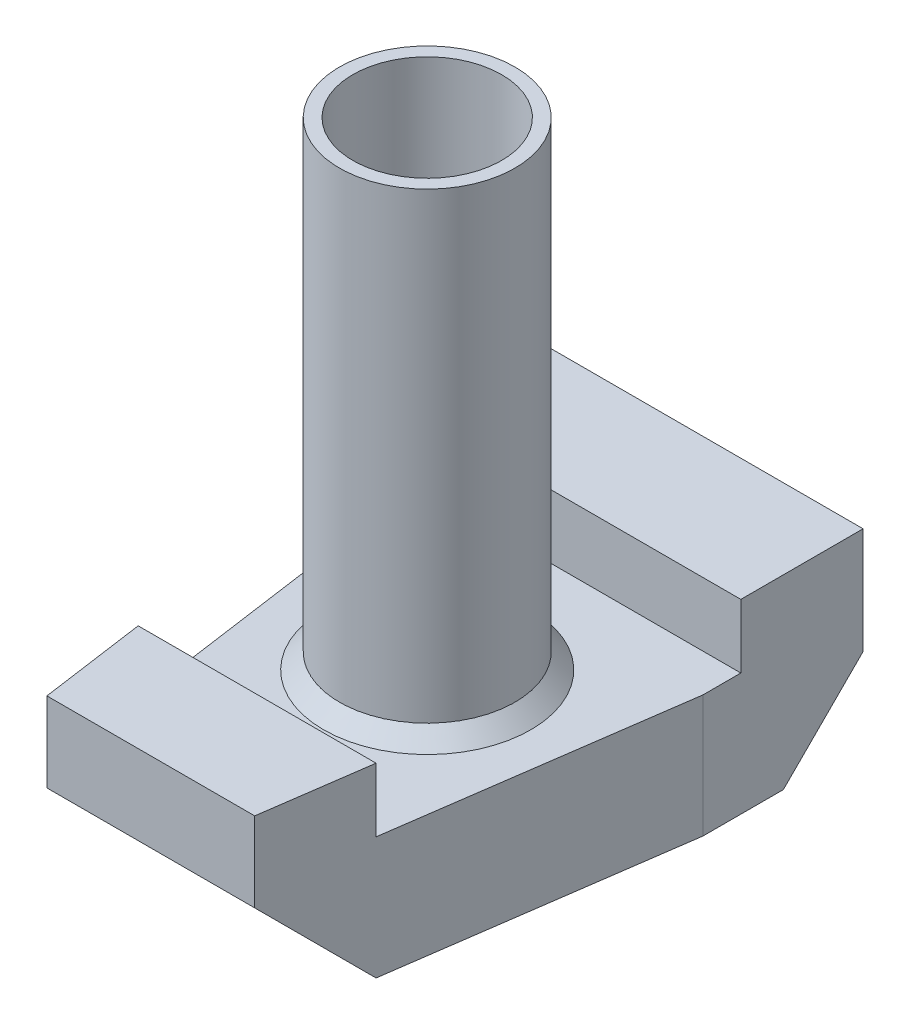
ISO-10303-21;
HEADER;
FILE_DESCRIPTION(('STEP AP214'),'2;1');
FILE_NAME('part.step','',(''),(''),'','','');
FILE_SCHEMA(('AUTOMOTIVE_DESIGN { 1 0 10303 214 1 1 1 1 }'));
ENDSEC;
DATA;
#1=APPLICATION_CONTEXT('core data for automotive mechanical design processes');
#2=APPLICATION_PROTOCOL_DEFINITION('international standard','automotive_design',2000,#1);
#3=PRODUCT_CONTEXT('',#1,'mechanical');
#4=PRODUCT('Part','Part','',(#3));
#5=PRODUCT_RELATED_PRODUCT_CATEGORY('part','',(#4));
#6=PRODUCT_DEFINITION_FORMATION('','',#4);
#7=PRODUCT_DEFINITION_CONTEXT('part definition',#1,'design');
#8=PRODUCT_DEFINITION('design','',#6,#7);
#9=PRODUCT_DEFINITION_SHAPE('','',#8);
#10=(LENGTH_UNIT() NAMED_UNIT(*) SI_UNIT(.MILLI.,.METRE.));
#11=(NAMED_UNIT(*) PLANE_ANGLE_UNIT() SI_UNIT($,.RADIAN.));
#12=(NAMED_UNIT(*) SI_UNIT($,.STERADIAN.) SOLID_ANGLE_UNIT());
#13=UNCERTAINTY_MEASURE_WITH_UNIT(LENGTH_MEASURE(1.E-05),#10,'distance_accuracy_value','');
#14=(GEOMETRIC_REPRESENTATION_CONTEXT(3) GLOBAL_UNCERTAINTY_ASSIGNED_CONTEXT((#13)) GLOBAL_UNIT_ASSIGNED_CONTEXT((#10,
#11,#12)) REPRESENTATION_CONTEXT('',''));
#15=CARTESIAN_POINT('',(0.,0.,0.));
#16=DIRECTION('',(0.,0.,1.));
#17=DIRECTION('',(1.,0.,0.));
#18=AXIS2_PLACEMENT_3D('',#15,#16,#17);
#19=CARTESIAN_POINT('',(30.,113.,52.));
#20=DIRECTION('',(0.,1.,0.));
#21=DIRECTION('',(0.,0.,1.));
#22=AXIS2_PLACEMENT_3D('',#19,#20,#21);
#23=CYLINDRICAL_SURFACE('',#22,16.5);
#24=CARTESIAN_POINT('',(30.,23.,52.));
#25=DIRECTION('',(0.,1.,0.));
#26=DIRECTION('',(0.,0.,1.));
#27=AXIS2_PLACEMENT_3D('',#24,#25,#26);
#28=CIRCLE('',#27,16.5);
#29=CARTESIAN_POINT('',(30.,23.,68.5));
#30=VERTEX_POINT('',#29);
#31=EDGE_CURVE('E12',#30,#30,#28,.T.);
#32=ORIENTED_EDGE('',*,*,#31,.F.);
#33=EDGE_LOOP('',(#32));
#34=FACE_BOUND('',#33,.T.);
#35=CARTESIAN_POINT('',(30.,26.,52.));
#36=DIRECTION('',(0.,1.,0.));
#37=DIRECTION('',(0.,0.,1.));
#38=AXIS2_PLACEMENT_3D('',#35,#36,#37);
#39=CIRCLE('',#38,16.5);
#40=CARTESIAN_POINT('',(30.,26.,68.5));
#41=VERTEX_POINT('',#40);
#42=EDGE_CURVE('E60',#41,#41,#39,.T.);
#43=ORIENTED_EDGE('',*,*,#42,.T.);
#44=EDGE_LOOP('',(#43));
#45=FACE_BOUND('',#44,.T.);
#46=ADVANCED_FACE('F50',(#34,#45),#23,.F.);
#47=CARTESIAN_POINT('',(49.5,23.,52.));
#48=DIRECTION('',(0.,1.,0.));
#49=DIRECTION('',(0.,0.,1.));
#50=AXIS2_PLACEMENT_3D('',#47,#48,#49);
#51=PLANE('',#50);
#52=CARTESIAN_POINT('',(30.,23.,52.));
#53=DIRECTION('',(0.,1.,0.));
#54=DIRECTION('',(0.,0.,1.));
#55=AXIS2_PLACEMENT_3D('',#52,#53,#54);
#56=CIRCLE('',#55,19.5);
#57=CARTESIAN_POINT('',(30.,23.,71.5));
#58=VERTEX_POINT('',#57);
#59=EDGE_CURVE('E56',#58,#58,#56,.T.);
#60=ORIENTED_EDGE('',*,*,#59,.F.);
#61=EDGE_LOOP('',(#60));
#62=FACE_BOUND('',#61,.T.);
#63=ORIENTED_EDGE('',*,*,#31,.T.);
#64=EDGE_LOOP('',(#63));
#65=FACE_BOUND('',#64,.T.);
#66=ADVANCED_FACE('F70',(#62,#65),#51,.F.);
#67=CARTESIAN_POINT('',(30.,23.,52.));
#68=DIRECTION('',(0.,-1.,0.));
#69=DIRECTION('',(0.,0.,-1.));
#70=AXIS2_PLACEMENT_3D('',#67,#68,#69);
#71=CONICAL_SURFACE('',#70,19.5,0.785398163397451);
#72=ORIENTED_EDGE('',*,*,#42,.F.);
#73=EDGE_LOOP('',(#72));
#74=FACE_BOUND('',#73,.T.);
#75=ORIENTED_EDGE('',*,*,#59,.T.);
#76=EDGE_LOOP('',(#75));
#77=FACE_BOUND('',#76,.T.);
#78=ADVANCED_FACE('F68',(#74,#77),#71,.T.);
#79=CLOSED_SHELL('',(#46,#66,#78));
#80=MANIFOLD_SOLID_BREP('B2',#79);
#81=CARTESIAN_POINT('',(30.,80.,52.));
#82=DIRECTION('',(0.,-1.,0.));
#83=DIRECTION('',(0.,0.,-1.));
#84=AXIS2_PLACEMENT_3D('',#81,#82,#83);
#85=CYLINDRICAL_SURFACE('',#84,10.);
#86=CARTESIAN_POINT('',(30.,0.,52.));
#87=DIRECTION('',(0.,-1.,0.));
#88=DIRECTION('',(0.,0.,-1.));
#89=AXIS2_PLACEMENT_3D('',#86,#87,#88);
#90=CIRCLE('',#89,10.);
#91=CARTESIAN_POINT('',(30.,0.,42.));
#92=VERTEX_POINT('',#91);
#93=EDGE_CURVE('E272',#92,#92,#90,.F.);
#94=ORIENTED_EDGE('',*,*,#93,.F.);
#95=EDGE_LOOP('',(#94));
#96=FACE_BOUND('',#95,.T.);
#97=CARTESIAN_POINT('',(30.,23.,52.));
#98=DIRECTION('',(0.,-1.,0.));
#99=DIRECTION('',(0.,0.,-1.));
#100=AXIS2_PLACEMENT_3D('',#97,#98,#99);
#101=CIRCLE('',#100,10.);
#102=CARTESIAN_POINT('',(30.,23.,42.));
#103=VERTEX_POINT('',#102);
#104=EDGE_CURVE('E398',#103,#103,#101,.F.);
#105=ORIENTED_EDGE('',*,*,#104,.T.);
#106=EDGE_LOOP('',(#105));
#107=FACE_BOUND('',#106,.T.);
#108=ADVANCED_FACE('F96',(#96,#107),#85,.F.);
#109=CARTESIAN_POINT('',(0.,0.,15.));
#110=DIRECTION('',(0.,0.707106781186548,0.707106781186548));
#111=DIRECTION('',(0.,-0.707106781186548,0.707106781186548));
#112=AXIS2_PLACEMENT_3D('',#109,#110,#111);
#113=PLANE('',#112);
#114=DIRECTION('',(-1.,0.,0.));
#115=VECTOR('',#114,1.);
#116=CARTESIAN_POINT('',(30.,15.,0.));
#117=LINE('',#116,#115);
#118=CARTESIAN_POINT('',(60.,15.,0.));
#119=VERTEX_POINT('',#118);
#120=CARTESIAN_POINT('',(0.,15.,0.));
#121=VERTEX_POINT('',#120);
#122=EDGE_CURVE('E235',#119,#121,#117,.T.);
#123=ORIENTED_EDGE('',*,*,#122,.F.);
#124=DIRECTION('',(0.,0.707106781186547,-0.707106781186547));
#125=VECTOR('',#124,1.);
#126=CARTESIAN_POINT('',(60.,0.,15.));
#127=LINE('',#126,#125);
#128=CARTESIAN_POINT('',(60.,0.,15.));
#129=VERTEX_POINT('',#128);
#130=EDGE_CURVE('E260',#129,#119,#127,.T.);
#131=ORIENTED_EDGE('',*,*,#130,.F.);
#132=DIRECTION('',(1.,0.,0.));
#133=VECTOR('',#132,1.);
#134=CARTESIAN_POINT('',(0.,0.,15.));
#135=LINE('',#134,#133);
#136=CARTESIAN_POINT('',(0.,0.,15.));
#137=VERTEX_POINT('',#136);
#138=EDGE_CURVE('E267',#137,#129,#135,.T.);
#139=ORIENTED_EDGE('',*,*,#138,.F.);
#140=DIRECTION('',(0.,-0.707106781186547,0.707106781186547));
#141=VECTOR('',#140,1.);
#142=CARTESIAN_POINT('',(0.,15.,0.));
#143=LINE('',#142,#141);
#144=EDGE_CURVE('E273',#121,#137,#143,.T.);
#145=ORIENTED_EDGE('',*,*,#144,.F.);
#146=EDGE_LOOP('',(#123,#131,#139,#145));
#147=FACE_BOUND('',#146,.T.);
#148=ADVANCED_FACE('F451',(#147),#113,.F.);
#149=CARTESIAN_POINT('',(30.,35.,0.));
#150=DIRECTION('',(0.,0.,-1.));
#151=DIRECTION('',(-1.,0.,0.));
#152=AXIS2_PLACEMENT_3D('',#149,#150,#151);
#153=PLANE('',#152);
#154=DIRECTION('',(0.,1.,0.));
#155=VECTOR('',#154,1.);
#156=CARTESIAN_POINT('',(60.,35.,0.));
#157=LINE('',#156,#155);
#158=CARTESIAN_POINT('',(60.,35.,0.));
#159=VERTEX_POINT('',#158);
#160=EDGE_CURVE('E256',#119,#159,#157,.T.);
#161=ORIENTED_EDGE('',*,*,#160,.F.);
#162=ORIENTED_EDGE('',*,*,#122,.T.);
#163=DIRECTION('',(0.,1.,0.));
#164=VECTOR('',#163,1.);
#165=CARTESIAN_POINT('',(0.,35.,0.));
#166=LINE('',#165,#164);
#167=CARTESIAN_POINT('',(0.,35.,0.));
#168=VERTEX_POINT('',#167);
#169=EDGE_CURVE('E275',#168,#121,#166,.F.);
#170=ORIENTED_EDGE('',*,*,#169,.F.);
#171=DIRECTION('',(-1.,0.,0.));
#172=VECTOR('',#171,1.);
#173=CARTESIAN_POINT('',(30.,35.,0.));
#174=LINE('',#173,#172);
#175=EDGE_CURVE('E281',#159,#168,#174,.T.);
#176=ORIENTED_EDGE('',*,*,#175,.F.);
#177=EDGE_LOOP('',(#161,#162,#170,#176));
#178=FACE_BOUND('',#177,.T.);
#179=ADVANCED_FACE('F455',(#178),#153,.T.);
#180=CARTESIAN_POINT('',(0.,0.,84.));
#181=DIRECTION('',(0.,0.707106781186548,-0.707106781186547));
#182=DIRECTION('',(0.,0.707106781186547,0.707106781186548));
#183=AXIS2_PLACEMENT_3D('',#180,#181,#182);
#184=PLANE('',#183);
#185=DIRECTION('',(1.,0.,0.));
#186=VECTOR('',#185,1.);
#187=CARTESIAN_POINT('',(0.,0.,84.));
#188=LINE('',#187,#186);
#189=CARTESIAN_POINT('',(52.3778832549067,0.,84.));
#190=VERTEX_POINT('',#189);
#191=CARTESIAN_POINT('',(7.62211674509327,0.,84.));
#192=VERTEX_POINT('',#191);
#193=EDGE_CURVE('E264',#190,#192,#188,.F.);
#194=ORIENTED_EDGE('',*,*,#193,.F.);
#195=DIRECTION('',(0.0995651231268555,-0.703593201451213,-0.703593201451213));
#196=VECTOR('',#195,1.);
#197=CARTESIAN_POINT('',(51.858650102781,3.66924585970003,87.6692458597));
#198=LINE('',#197,#196);
#199=CARTESIAN_POINT('',(49.5476932268765,20.,104.));
#200=VERTEX_POINT('',#199);
#201=EDGE_CURVE('E414',#200,#190,#198,.T.);
#202=ORIENTED_EDGE('',*,*,#201,.F.);
#203=DIRECTION('',(1.,0.,0.));
#204=VECTOR('',#203,1.);
#205=CARTESIAN_POINT('',(8.63207958549231,20.,104.));
#206=LINE('',#205,#204);
#207=CARTESIAN_POINT('',(10.4523067731235,20.,104.));
#208=VERTEX_POINT('',#207);
#209=EDGE_CURVE('E278',#208,#200,#206,.T.);
#210=ORIENTED_EDGE('',*,*,#209,.F.);
#211=DIRECTION('',(0.0995651231268555,0.703593201451213,0.703593201451213));
#212=VECTOR('',#211,1.);
#213=CARTESIAN_POINT('',(7.54655707262303,-0.533954764322473,83.4660452356775));
#214=LINE('',#213,#212);
#215=EDGE_CURVE('E341',#192,#208,#214,.T.);
#216=ORIENTED_EDGE('',*,*,#215,.F.);
#217=EDGE_LOOP('',(#194,#202,#210,#216));
#218=FACE_BOUND('',#217,.T.);
#219=ADVANCED_FACE('F430',(#218),#184,.F.);
#220=CARTESIAN_POINT('',(8.63207958549231,35.,104.));
#221=DIRECTION('',(0.,0.,1.));
#222=DIRECTION('',(1.,0.,0.));
#223=AXIS2_PLACEMENT_3D('',#220,#221,#222);
#224=PLANE('',#223);
#225=DIRECTION('',(0.,1.,0.));
#226=VECTOR('',#225,1.);
#227=CARTESIAN_POINT('',(49.5476932268765,35.,104.));
#228=LINE('',#227,#226);
#229=CARTESIAN_POINT('',(49.5476932268765,35.,104.));
#230=VERTEX_POINT('',#229);
#231=EDGE_CURVE('E236',#200,#230,#228,.T.);
#232=ORIENTED_EDGE('',*,*,#231,.T.);
#233=DIRECTION('',(1.,0.,0.));
#234=VECTOR('',#233,1.);
#235=CARTESIAN_POINT('',(30.,35.,104.));
#236=LINE('',#235,#234);
#237=CARTESIAN_POINT('',(10.4523067731235,35.,104.));
#238=VERTEX_POINT('',#237);
#239=EDGE_CURVE('E234',#238,#230,#236,.T.);
#240=ORIENTED_EDGE('',*,*,#239,.F.);
#241=DIRECTION('',(0.,-1.,0.));
#242=VECTOR('',#241,1.);
#243=CARTESIAN_POINT('',(10.4523067731235,35.,104.));
#244=LINE('',#243,#242);
#245=EDGE_CURVE('E415',#238,#208,#244,.T.);
#246=ORIENTED_EDGE('',*,*,#245,.T.);
#247=ORIENTED_EDGE('',*,*,#209,.T.);
#248=EDGE_LOOP('',(#232,#240,#246,#247));
#249=FACE_BOUND('',#248,.T.);
#250=ADVANCED_FACE('F425',(#249),#224,.T.);
#251=CARTESIAN_POINT('',(0.,23.,0.));
#252=DIRECTION('',(0.,-1.,0.));
#253=DIRECTION('',(0.,0.,-1.));
#254=AXIS2_PLACEMENT_3D('',#251,#252,#253);
#255=PLANE('',#254);
#256=CARTESIAN_POINT('',(30.,23.,52.));
#257=DIRECTION('',(0.,-1.,0.));
#258=DIRECTION('',(0.,0.,-1.));
#259=AXIS2_PLACEMENT_3D('',#256,#257,#258);
#260=CIRCLE('',#259,14.);
#261=CARTESIAN_POINT('',(30.,23.,38.));
#262=VERTEX_POINT('',#261);
#263=EDGE_CURVE('E392',#262,#262,#260,.F.);
#264=ORIENTED_EDGE('',*,*,#263,.T.);
#265=EDGE_LOOP('',(#264));
#266=FACE_BOUND('',#265,.T.);
#267=ORIENTED_EDGE('',*,*,#104,.F.);
#268=EDGE_LOOP('',(#267));
#269=FACE_BOUND('',#268,.T.);
#270=ADVANCED_FACE('F459',(#266,#269),#255,.F.);
#271=CARTESIAN_POINT('',(0.,35.,0.));
#272=DIRECTION('',(0.,-1.,0.));
#273=DIRECTION('',(0.,0.,-1.));
#274=AXIS2_PLACEMENT_3D('',#271,#272,#273);
#275=PLANE('',#274);
#276=DIRECTION('',(0.,0.,-1.));
#277=VECTOR('',#276,1.);
#278=CARTESIAN_POINT('',(0.,35.,0.));
#279=LINE('',#278,#277);
#280=CARTESIAN_POINT('',(0.,35.,23.));
#281=VERTEX_POINT('',#280);
#282=EDGE_CURVE('E141',#281,#168,#279,.T.);
#283=ORIENTED_EDGE('',*,*,#282,.F.);
#284=DIRECTION('',(1.,0.,0.));
#285=VECTOR('',#284,1.);
#286=CARTESIAN_POINT('',(60.,35.,23.));
#287=LINE('',#286,#285);
#288=CARTESIAN_POINT('',(60.,35.,23.));
#289=VERTEX_POINT('',#288);
#290=EDGE_CURVE('E252',#289,#281,#287,.F.);
#291=ORIENTED_EDGE('',*,*,#290,.F.);
#292=DIRECTION('',(0.,0.,1.));
#293=VECTOR('',#292,1.);
#294=CARTESIAN_POINT('',(60.,35.,0.));
#295=LINE('',#294,#293);
#296=EDGE_CURVE('E259',#159,#289,#295,.T.);
#297=ORIENTED_EDGE('',*,*,#296,.F.);
#298=ORIENTED_EDGE('',*,*,#175,.T.);
#299=EDGE_LOOP('',(#283,#291,#297,#298));
#300=FACE_BOUND('',#299,.T.);
#301=ADVANCED_FACE('F457',(#300),#275,.F.);
#302=CARTESIAN_POINT('',(0.,35.,0.));
#303=DIRECTION('',(-1.,0.,0.));
#304=DIRECTION('',(0.,0.,1.));
#305=AXIS2_PLACEMENT_3D('',#302,#303,#304);
#306=PLANE('',#305);
#307=DIRECTION('',(0.,-1.,0.));
#308=VECTOR('',#307,1.);
#309=CARTESIAN_POINT('',(0.,35.,30.1370673375027));
#310=LINE('',#309,#308);
#311=CARTESIAN_POINT('',(0.,23.,30.1370673375027));
#312=VERTEX_POINT('',#311);
#313=CARTESIAN_POINT('',(0.,0.,30.1370673375027));
#314=VERTEX_POINT('',#313);
#315=EDGE_CURVE('E395',#312,#314,#310,.T.);
#316=ORIENTED_EDGE('',*,*,#315,.F.);
#317=DIRECTION('',(0.,0.,1.));
#318=VECTOR('',#317,1.);
#319=CARTESIAN_POINT('',(0.,23.,0.));
#320=LINE('',#319,#318);
#321=CARTESIAN_POINT('',(0.,23.,23.));
#322=VERTEX_POINT('',#321);
#323=EDGE_CURVE('E105',#322,#312,#320,.T.);
#324=ORIENTED_EDGE('',*,*,#323,.F.);
#325=DIRECTION('',(0.,1.,0.));
#326=VECTOR('',#325,1.);
#327=CARTESIAN_POINT('',(0.,23.,23.));
#328=LINE('',#327,#326);
#329=EDGE_CURVE('E249',#281,#322,#328,.F.);
#330=ORIENTED_EDGE('',*,*,#329,.F.);
#331=ORIENTED_EDGE('',*,*,#282,.T.);
#332=ORIENTED_EDGE('',*,*,#169,.T.);
#333=ORIENTED_EDGE('',*,*,#144,.T.);
#334=DIRECTION('',(0.,0.,-1.));
#335=VECTOR('',#334,1.);
#336=CARTESIAN_POINT('',(0.,0.,0.));
#337=LINE('',#336,#335);
#338=EDGE_CURVE('E269',#314,#137,#337,.T.);
#339=ORIENTED_EDGE('',*,*,#338,.F.);
#340=EDGE_LOOP('',(#316,#324,#330,#331,#332,#333,#339));
#341=FACE_BOUND('',#340,.T.);
#342=ADVANCED_FACE('F444',(#341),#306,.T.);
#343=CARTESIAN_POINT('',(0.,0.,0.));
#344=DIRECTION('',(0.,-1.,0.));
#345=DIRECTION('',(0.,0.,-1.));
#346=AXIS2_PLACEMENT_3D('',#343,#344,#345);
#347=PLANE('',#346);
#348=CARTESIAN_POINT('',(30.,0.,35.5));
#349=DIRECTION('',(0.,-1.,0.));
#350=DIRECTION('',(0.,0.,-1.));
#351=AXIS2_PLACEMENT_3D('',#348,#349,#350);
#352=CIRCLE('',#351,2.09999999999999);
#353=CARTESIAN_POINT('',(30.,0.,33.4));
#354=VERTEX_POINT('',#353);
#355=EDGE_CURVE('E330',#354,#354,#352,.T.);
#356=ORIENTED_EDGE('',*,*,#355,.F.);
#357=EDGE_LOOP('',(#356));
#358=FACE_BOUND('',#357,.T.);
#359=CARTESIAN_POINT('',(29.9999999999999,0.,68.5));
#360=DIRECTION('',(0.,-1.,0.));
#361=DIRECTION('',(0.,0.,-1.));
#362=AXIS2_PLACEMENT_3D('',#359,#360,#361);
#363=CIRCLE('',#362,2.09999999999999);
#364=CARTESIAN_POINT('',(29.9999999999999,0.,66.4));
#365=VERTEX_POINT('',#364);
#366=EDGE_CURVE('E333',#365,#365,#363,.T.);
#367=ORIENTED_EDGE('',*,*,#366,.F.);
#368=EDGE_LOOP('',(#367));
#369=FACE_BOUND('',#368,.T.);
#370=ORIENTED_EDGE('',*,*,#193,.T.);
#371=DIRECTION('',(0.140113572243511,0.,0.99013543865128));
#372=VECTOR('',#371,1.);
#373=CARTESIAN_POINT('',(7.64194414684103,0.,84.1401135722435));
#374=LINE('',#373,#372);
#375=EDGE_CURVE('E255',#314,#192,#374,.T.);
#376=ORIENTED_EDGE('',*,*,#375,.F.);
#377=ORIENTED_EDGE('',*,*,#338,.T.);
#378=ORIENTED_EDGE('',*,*,#138,.T.);
#379=DIRECTION('',(0.,0.,-1.));
#380=VECTOR('',#379,1.);
#381=CARTESIAN_POINT('',(60.,0.,0.));
#382=LINE('',#381,#380);
#383=CARTESIAN_POINT('',(60.,0.,30.1370673375028));
#384=VERTEX_POINT('',#383);
#385=EDGE_CURVE('E129',#384,#129,#382,.T.);
#386=ORIENTED_EDGE('',*,*,#385,.F.);
#387=DIRECTION('',(0.140113572243511,0.,-0.99013543865128));
#388=VECTOR('',#387,1.);
#389=CARTESIAN_POINT('',(52.358055853159,0.,84.1401135722435));
#390=LINE('',#389,#388);
#391=EDGE_CURVE('E241',#190,#384,#390,.T.);
#392=ORIENTED_EDGE('',*,*,#391,.F.);
#393=EDGE_LOOP('',(#370,#376,#377,#378,#386,#392));
#394=FACE_BOUND('',#393,.T.);
#395=ORIENTED_EDGE('',*,*,#93,.T.);
#396=EDGE_LOOP('',(#395));
#397=FACE_BOUND('',#396,.T.);
#398=ADVANCED_FACE('F432',(#358,#369,#394,#397),#347,.T.);
#399=CARTESIAN_POINT('',(60.,35.,0.));
#400=DIRECTION('',(1.,0.,0.));
#401=DIRECTION('',(0.,0.,-1.));
#402=AXIS2_PLACEMENT_3D('',#399,#400,#401);
#403=PLANE('',#402);
#404=ORIENTED_EDGE('',*,*,#160,.T.);
#405=ORIENTED_EDGE('',*,*,#296,.T.);
#406=DIRECTION('',(0.,1.,0.));
#407=VECTOR('',#406,1.);
#408=CARTESIAN_POINT('',(60.,23.,23.));
#409=LINE('',#408,#407);
#410=CARTESIAN_POINT('',(60.,23.,23.));
#411=VERTEX_POINT('',#410);
#412=EDGE_CURVE('E246',#411,#289,#409,.T.);
#413=ORIENTED_EDGE('',*,*,#412,.F.);
#414=DIRECTION('',(0.,0.,1.));
#415=VECTOR('',#414,1.);
#416=CARTESIAN_POINT('',(60.,23.,0.));
#417=LINE('',#416,#415);
#418=CARTESIAN_POINT('',(60.,23.,30.1370673375028));
#419=VERTEX_POINT('',#418);
#420=EDGE_CURVE('E48',#411,#419,#417,.T.);
#421=ORIENTED_EDGE('',*,*,#420,.T.);
#422=DIRECTION('',(0.,1.,0.));
#423=VECTOR('',#422,1.);
#424=CARTESIAN_POINT('',(60.,35.,30.1370673375028));
#425=LINE('',#424,#423);
#426=EDGE_CURVE('E239',#384,#419,#425,.T.);
#427=ORIENTED_EDGE('',*,*,#426,.F.);
#428=ORIENTED_EDGE('',*,*,#385,.T.);
#429=ORIENTED_EDGE('',*,*,#130,.T.);
#430=EDGE_LOOP('',(#404,#405,#413,#421,#427,#428,#429));
#431=FACE_BOUND('',#430,.T.);
#432=ADVANCED_FACE('F436',(#431),#403,.T.);
#433=CARTESIAN_POINT('',(0.,35.,0.));
#434=DIRECTION('',(0.,-1.,0.));
#435=DIRECTION('',(0.,0.,-1.));
#436=AXIS2_PLACEMENT_3D('',#433,#434,#435);
#437=PLANE('',#436);
#438=ORIENTED_EDGE('',*,*,#239,.T.);
#439=DIRECTION('',(-0.140113572243511,0.,0.99013543865128));
#440=VECTOR('',#439,1.);
#441=CARTESIAN_POINT('',(63.0030491572705,35.,8.91553007302037));
#442=LINE('',#441,#440);
#443=CARTESIAN_POINT('',(52.3778832549067,35.,84.));
#444=VERTEX_POINT('',#443);
#445=EDGE_CURVE('E219',#444,#230,#442,.T.);
#446=ORIENTED_EDGE('',*,*,#445,.F.);
#447=DIRECTION('',(-1.,0.,0.));
#448=VECTOR('',#447,1.);
#449=CARTESIAN_POINT('',(51.3679204145077,35.,84.));
#450=LINE('',#449,#448);
#451=CARTESIAN_POINT('',(7.62211674509326,35.,84.));
#452=VERTEX_POINT('',#451);
#453=EDGE_CURVE('E225',#452,#444,#450,.F.);
#454=ORIENTED_EDGE('',*,*,#453,.F.);
#455=DIRECTION('',(-0.140113572243511,0.,-0.99013543865128));
#456=VECTOR('',#455,1.);
#457=CARTESIAN_POINT('',(-4.18095794488078,35.,0.591645274160773));
#458=LINE('',#457,#456);
#459=EDGE_CURVE('E412',#238,#452,#458,.T.);
#460=ORIENTED_EDGE('',*,*,#459,.F.);
#461=EDGE_LOOP('',(#438,#446,#454,#460));
#462=FACE_BOUND('',#461,.T.);
#463=ADVANCED_FACE('F230',(#462),#437,.F.);
#464=CARTESIAN_POINT('',(30.,113.,52.));
#465=DIRECTION('',(0.,-1.,0.));
#466=DIRECTION('',(0.,0.,-1.));
#467=AXIS2_PLACEMENT_3D('',#464,#465,#466);
#468=CYLINDRICAL_SURFACE('',#467,14.);
#469=ORIENTED_EDGE('',*,*,#263,.F.);
#470=EDGE_LOOP('',(#469));
#471=FACE_BOUND('',#470,.T.);
#472=CARTESIAN_POINT('',(30.,113.,52.));
#473=DIRECTION('',(0.,-1.,0.));
#474=DIRECTION('',(0.,0.,-1.));
#475=AXIS2_PLACEMENT_3D('',#472,#473,#474);
#476=CIRCLE('',#475,14.);
#477=CARTESIAN_POINT('',(30.,113.,38.));
#478=VERTEX_POINT('',#477);
#479=EDGE_CURVE('E389',#478,#478,#476,.F.);
#480=ORIENTED_EDGE('',*,*,#479,.T.);
#481=EDGE_LOOP('',(#480));
#482=FACE_BOUND('',#481,.T.);
#483=ADVANCED_FACE('F481',(#471,#482),#468,.F.);
#484=CARTESIAN_POINT('',(7.64194414684103,35.,84.1401135722435));
#485=DIRECTION('',(-0.99013543865128,0.,0.140113572243511));
#486=DIRECTION('',(0.140113572243511,0.,0.99013543865128));
#487=AXIS2_PLACEMENT_3D('',#484,#485,#486);
#488=PLANE('',#487);
#489=ORIENTED_EDGE('',*,*,#375,.T.);
#490=ORIENTED_EDGE('',*,*,#215,.T.);
#491=ORIENTED_EDGE('',*,*,#245,.F.);
#492=ORIENTED_EDGE('',*,*,#459,.T.);
#493=DIRECTION('',(0.,1.,0.));
#494=VECTOR('',#493,1.);
#495=CARTESIAN_POINT('',(7.62211674509326,23.,84.));
#496=LINE('',#495,#494);
#497=CARTESIAN_POINT('',(7.62211674509327,23.,84.));
#498=VERTEX_POINT('',#497);
#499=EDGE_CURVE('E224',#498,#452,#496,.T.);
#500=ORIENTED_EDGE('',*,*,#499,.F.);
#501=DIRECTION('',(-0.140113572243511,0.,-0.99013543865128));
#502=VECTOR('',#501,1.);
#503=CARTESIAN_POINT('',(-4.18095794488078,23.,0.591645274160773));
#504=LINE('',#503,#502);
#505=EDGE_CURVE('E366',#498,#312,#504,.T.);
#506=ORIENTED_EDGE('',*,*,#505,.T.);
#507=ORIENTED_EDGE('',*,*,#315,.T.);
#508=EDGE_LOOP('',(#489,#490,#491,#492,#500,#506,#507));
#509=FACE_BOUND('',#508,.T.);
#510=ADVANCED_FACE('F446',(#509),#488,.T.);
#511=CARTESIAN_POINT('',(60.,23.,23.));
#512=DIRECTION('',(0.,0.,1.));
#513=DIRECTION('',(1.,0.,0.));
#514=AXIS2_PLACEMENT_3D('',#511,#512,#513);
#515=PLANE('',#514);
#516=DIRECTION('',(1.,0.,0.));
#517=VECTOR('',#516,1.);
#518=CARTESIAN_POINT('',(0.,23.,23.));
#519=LINE('',#518,#517);
#520=EDGE_CURVE('E364',#322,#411,#519,.T.);
#521=ORIENTED_EDGE('',*,*,#520,.T.);
#522=ORIENTED_EDGE('',*,*,#412,.T.);
#523=ORIENTED_EDGE('',*,*,#290,.T.);
#524=ORIENTED_EDGE('',*,*,#329,.T.);
#525=EDGE_LOOP('',(#521,#522,#523,#524));
#526=FACE_BOUND('',#525,.T.);
#527=ADVANCED_FACE('F442',(#526),#515,.T.);
#528=CARTESIAN_POINT('',(52.358055853159,35.,84.1401135722435));
#529=DIRECTION('',(0.99013543865128,0.,0.140113572243511));
#530=DIRECTION('',(0.140113572243511,0.,-0.99013543865128));
#531=AXIS2_PLACEMENT_3D('',#528,#529,#530);
#532=PLANE('',#531);
#533=ORIENTED_EDGE('',*,*,#391,.T.);
#534=ORIENTED_EDGE('',*,*,#426,.T.);
#535=DIRECTION('',(-0.140113572243511,0.,0.99013543865128));
#536=VECTOR('',#535,1.);
#537=CARTESIAN_POINT('',(63.0030491572705,23.,8.91553007302037));
#538=LINE('',#537,#536);
#539=CARTESIAN_POINT('',(52.3778832549067,23.,84.));
#540=VERTEX_POINT('',#539);
#541=EDGE_CURVE('E113',#419,#540,#538,.T.);
#542=ORIENTED_EDGE('',*,*,#541,.T.);
#543=DIRECTION('',(0.,-1.,0.));
#544=VECTOR('',#543,1.);
#545=CARTESIAN_POINT('',(52.3778832549067,23.,84.));
#546=LINE('',#545,#544);
#547=EDGE_CURVE('E216',#444,#540,#546,.T.);
#548=ORIENTED_EDGE('',*,*,#547,.F.);
#549=ORIENTED_EDGE('',*,*,#445,.T.);
#550=ORIENTED_EDGE('',*,*,#231,.F.);
#551=ORIENTED_EDGE('',*,*,#201,.T.);
#552=EDGE_LOOP('',(#533,#534,#542,#548,#549,#550,#551));
#553=FACE_BOUND('',#552,.T.);
#554=ADVANCED_FACE('F98',(#553),#532,.T.);
#555=CARTESIAN_POINT('',(51.3679204145077,23.,84.));
#556=DIRECTION('',(0.,0.,-1.));
#557=DIRECTION('',(-1.,0.,0.));
#558=AXIS2_PLACEMENT_3D('',#555,#556,#557);
#559=PLANE('',#558);
#560=DIRECTION('',(1.,0.,0.));
#561=VECTOR('',#560,1.);
#562=CARTESIAN_POINT('',(0.,23.,84.));
#563=LINE('',#562,#561);
#564=EDGE_CURVE('E362',#540,#498,#563,.F.);
#565=ORIENTED_EDGE('',*,*,#564,.T.);
#566=ORIENTED_EDGE('',*,*,#499,.T.);
#567=ORIENTED_EDGE('',*,*,#453,.T.);
#568=ORIENTED_EDGE('',*,*,#547,.T.);
#569=EDGE_LOOP('',(#565,#566,#567,#568));
#570=FACE_BOUND('',#569,.T.);
#571=ADVANCED_FACE('F238',(#570),#559,.T.);
#572=CARTESIAN_POINT('',(15.5341265269268,91.,52.));
#573=DIRECTION('',(1.,0.,0.));
#574=DIRECTION('',(0.,0.,-1.));
#575=AXIS2_PLACEMENT_3D('',#572,#573,#574);
#576=PLANE('',#575);
#577=CARTESIAN_POINT('',(15.5341265269268,46.,52.));
#578=DIRECTION('',(-1.,0.,0.));
#579=DIRECTION('',(0.,0.,1.));
#580=AXIS2_PLACEMENT_3D('',#577,#578,#579);
#581=CIRCLE('',#580,5.);
#582=CARTESIAN_POINT('',(15.5341265269268,46.,47.));
#583=VERTEX_POINT('',#582);
#584=CARTESIAN_POINT('',(15.5341265269268,46.,57.));
#585=VERTEX_POINT('',#584);
#586=EDGE_CURVE('E361',#583,#585,#581,.T.);
#587=ORIENTED_EDGE('',*,*,#586,.T.);
#588=DIRECTION('',(0.,1.,0.));
#589=VECTOR('',#588,1.);
#590=CARTESIAN_POINT('',(15.5341265269268,46.,57.));
#591=LINE('',#590,#589);
#592=CARTESIAN_POINT('',(15.5341265269268,91.,57.));
#593=VERTEX_POINT('',#592);
#594=EDGE_CURVE('E244',#593,#585,#591,.F.);
#595=ORIENTED_EDGE('',*,*,#594,.F.);
#596=CARTESIAN_POINT('',(15.5341265269268,91.,52.));
#597=DIRECTION('',(-1.,0.,0.));
#598=DIRECTION('',(0.,0.,1.));
#599=AXIS2_PLACEMENT_3D('',#596,#597,#598);
#600=CIRCLE('',#599,5.);
#601=CARTESIAN_POINT('',(15.5341265269268,91.,47.));
#602=VERTEX_POINT('',#601);
#603=EDGE_CURVE('E351',#593,#602,#600,.T.);
#604=ORIENTED_EDGE('',*,*,#603,.T.);
#605=DIRECTION('',(0.,-1.,0.));
#606=VECTOR('',#605,1.);
#607=CARTESIAN_POINT('',(15.5341265269268,91.,47.));
#608=LINE('',#607,#606);
#609=EDGE_CURVE('E355',#583,#602,#608,.F.);
#610=ORIENTED_EDGE('',*,*,#609,.F.);
#611=EDGE_LOOP('',(#587,#595,#604,#610));
#612=FACE_BOUND('',#611,.T.);
#613=ADVANCED_FACE('F571',(#612),#576,.F.);
#614=CARTESIAN_POINT('',(30.,113.,52.));
#615=DIRECTION('',(0.,-1.,0.));
#616=DIRECTION('',(0.,0.,-1.));
#617=AXIS2_PLACEMENT_3D('',#614,#615,#616);
#618=PLANE('',#617);
#619=CARTESIAN_POINT('',(30.,113.,52.));
#620=DIRECTION('',(0.,-1.,0.));
#621=DIRECTION('',(0.,0.,-1.));
#622=AXIS2_PLACEMENT_3D('',#619,#620,#621);
#623=CIRCLE('',#622,16.5);
#624=CARTESIAN_POINT('',(30.,113.,35.5));
#625=VERTEX_POINT('',#624);
#626=EDGE_CURVE('E350',#625,#625,#623,.T.);
#627=ORIENTED_EDGE('',*,*,#626,.F.);
#628=EDGE_LOOP('',(#627));
#629=FACE_BOUND('',#628,.T.);
#630=ORIENTED_EDGE('',*,*,#479,.F.);
#631=EDGE_LOOP('',(#630));
#632=FACE_BOUND('',#631,.T.);
#633=ADVANCED_FACE('F586',(#629,#632),#618,.F.);
#634=CARTESIAN_POINT('',(0.,23.,0.));
#635=DIRECTION('',(0.,-1.,0.));
#636=DIRECTION('',(0.,0.,-1.));
#637=AXIS2_PLACEMENT_3D('',#634,#635,#636);
#638=PLANE('',#637);
#639=ORIENTED_EDGE('',*,*,#541,.F.);
#640=ORIENTED_EDGE('',*,*,#420,.F.);
#641=ORIENTED_EDGE('',*,*,#520,.F.);
#642=ORIENTED_EDGE('',*,*,#323,.T.);
#643=ORIENTED_EDGE('',*,*,#505,.F.);
#644=ORIENTED_EDGE('',*,*,#564,.F.);
#645=EDGE_LOOP('',(#639,#640,#641,#642,#643,#644));
#646=FACE_BOUND('',#645,.T.);
#647=CARTESIAN_POINT('',(30.,23.,52.));
#648=DIRECTION('',(0.,-1.,0.));
#649=DIRECTION('',(0.,0.,-1.));
#650=AXIS2_PLACEMENT_3D('',#647,#648,#649);
#651=CIRCLE('',#650,16.5);
#652=CARTESIAN_POINT('',(30.,23.,35.5));
#653=VERTEX_POINT('',#652);
#654=EDGE_CURVE('E347',#653,#653,#651,.F.);
#655=ORIENTED_EDGE('',*,*,#654,.F.);
#656=EDGE_LOOP('',(#655));
#657=FACE_BOUND('',#656,.T.);
#658=ADVANCED_FACE('F438',(#646,#657),#638,.F.);
#659=CARTESIAN_POINT('',(16.5,46.,57.));
#660=DIRECTION('',(0.,0.,-1.));
#661=DIRECTION('',(-1.,0.,0.));
#662=AXIS2_PLACEMENT_3D('',#659,#660,#661);
#663=PLANE('',#662);
#664=ORIENTED_EDGE('',*,*,#594,.T.);
#665=DIRECTION('',(-1.,0.,0.));
#666=VECTOR('',#665,1.);
#667=CARTESIAN_POINT('',(16.5,46.,57.));
#668=LINE('',#667,#666);
#669=CARTESIAN_POINT('',(14.2758148064836,46.,57.));
#670=VERTEX_POINT('',#669);
#671=EDGE_CURVE('E359',#585,#670,#668,.T.);
#672=ORIENTED_EDGE('',*,*,#671,.T.);
#673=DIRECTION('',(0.,-1.,0.));
#674=VECTOR('',#673,1.);
#675=CARTESIAN_POINT('',(14.2758148064836,113.,57.));
#676=LINE('',#675,#674);
#677=CARTESIAN_POINT('',(14.2758148064836,91.,57.));
#678=VERTEX_POINT('',#677);
#679=EDGE_CURVE('E344',#678,#670,#676,.T.);
#680=ORIENTED_EDGE('',*,*,#679,.F.);
#681=DIRECTION('',(-1.,0.,0.));
#682=VECTOR('',#681,1.);
#683=CARTESIAN_POINT('',(16.5,91.,57.));
#684=LINE('',#683,#682);
#685=EDGE_CURVE('E352',#678,#593,#684,.F.);
#686=ORIENTED_EDGE('',*,*,#685,.T.);
#687=EDGE_LOOP('',(#664,#672,#680,#686));
#688=FACE_BOUND('',#687,.T.);
#689=ADVANCED_FACE('F601',(#688),#663,.T.);
#690=CARTESIAN_POINT('',(16.5,46.,52.));
#691=DIRECTION('',(-1.,0.,0.));
#692=DIRECTION('',(0.,0.,1.));
#693=AXIS2_PLACEMENT_3D('',#690,#691,#692);
#694=CYLINDRICAL_SURFACE('',#693,5.);
#695=ORIENTED_EDGE('',*,*,#671,.F.);
#696=ORIENTED_EDGE('',*,*,#586,.F.);
#697=DIRECTION('',(1.,0.,0.));
#698=VECTOR('',#697,1.);
#699=CARTESIAN_POINT('',(16.5,46.,47.));
#700=LINE('',#699,#698);
#701=CARTESIAN_POINT('',(14.2758148064836,46.,47.));
#702=VERTEX_POINT('',#701);
#703=EDGE_CURVE('E356',#702,#583,#700,.T.);
#704=ORIENTED_EDGE('',*,*,#703,.F.);
#705=CARTESIAN_POINT('',(14.2758148064836,46.,57.));
#706=CARTESIAN_POINT('',(14.2758347042657,45.86284656948,57.0000185391216));
#707=CARTESIAN_POINT('',(14.2740209913233,45.7257006491758,56.9943574844226));
#708=CARTESIAN_POINT('',(14.2668718241494,45.4524570081614,56.9718140567295));
#709=CARTESIAN_POINT('',(14.2615371752369,45.3163590549567,56.9549342497156));
#710=CARTESIAN_POINT('',(14.2475095138853,45.0465275381249,56.9101486058641));
#711=CARTESIAN_POINT('',(14.2388251543059,44.9127888035062,56.8822711735314));
#712=CARTESIAN_POINT('',(14.21837091679,44.6482606673925,56.8157451347993));
#713=CARTESIAN_POINT('',(14.2066009555467,44.517471345631,56.7770962375839));
#714=CARTESIAN_POINT('',(14.1803327868344,44.2598033763957,56.6893731041142));
#715=CARTESIAN_POINT('',(14.1658362411487,44.1329224014151,56.640305215631));
#716=CARTESIAN_POINT('',(14.1345339404442,43.8837962069146,56.5321246355558));
#717=CARTESIAN_POINT('',(14.1177273264607,43.7615527334567,56.4730082056186));
#718=CARTESIAN_POINT('',(14.0645365268123,43.4029393645796,56.2811963900849));
#719=CARTESIAN_POINT('',(14.025365607717,43.1745399557493,56.1339882960289));
#720=CARTESIAN_POINT('',(13.9426482134889,42.7387378512004,55.8002338293912));
#721=CARTESIAN_POINT('',(13.8990076271453,42.5321387998549,55.6126680621425));
#722=CARTESIAN_POINT('',(13.8130559169251,42.1527507727528,55.2056278705022));
#723=CARTESIAN_POINT('',(13.7707450196402,41.9799675335879,54.9861480431246));
#724=CARTESIAN_POINT('',(13.691144604,41.6696648144409,54.5157965444956));
#725=CARTESIAN_POINT('',(13.653980153633,41.5329680728112,54.2643593113616));
#726=CARTESIAN_POINT('',(13.5899662746709,41.3041150592881,53.7407567294877));
#727=CARTESIAN_POINT('',(13.5631141443915,41.211947119834,53.4685968322173));
#728=CARTESIAN_POINT('',(13.5234207797792,41.0774305623901,52.9196837049522));
#729=CARTESIAN_POINT('',(13.5101940795315,41.0337085099107,52.6432954093506));
#730=CARTESIAN_POINT('',(13.4978833617221,40.9929793967571,52.0868045177732));
#731=CARTESIAN_POINT('',(13.4987966068989,40.9959632945779,51.8067026511733));
#732=CARTESIAN_POINT('',(13.5143914366323,41.0476434581015,51.2603917055826));
#733=CARTESIAN_POINT('',(13.5286247008456,41.0948513028944,50.9940269326399));
#734=CARTESIAN_POINT('',(13.5687155321555,41.2312136273986,50.4731919344004));
#735=CARTESIAN_POINT('',(13.5945737123991,41.3203703196803,50.218722337287));
#736=CARTESIAN_POINT('',(13.6556174677113,41.539061938896,49.7254136630516));
#737=CARTESIAN_POINT('',(13.690909554249,41.6690611286614,49.4867945793036));
#738=CARTESIAN_POINT('',(13.7671103052395,41.9655057439828,49.0341974298054));
#739=CARTESIAN_POINT('',(13.8080202524472,42.1319594985747,48.8202250123319));
#740=CARTESIAN_POINT('',(13.8712755100749,42.4091403073774,48.5178332229265));
#741=CARTESIAN_POINT('',(13.8931091310091,42.5082799913199,48.4184363103847));
#742=CARTESIAN_POINT('',(13.9365677640462,42.7145754270819,48.2283119368936));
#743=CARTESIAN_POINT('',(13.9581928450107,42.8217284228403,48.1375815194573));
#744=CARTESIAN_POINT('',(14.0006464724826,43.0434547226271,47.9653290051389));
#745=CARTESIAN_POINT('',(14.0214744680566,43.15803301667,47.8838132038542));
#746=CARTESIAN_POINT('',(14.0617158630217,43.3937801798469,47.7306480203758));
#747=CARTESIAN_POINT('',(14.0811298127884,43.5149464523867,47.658994789701));
#748=CARTESIAN_POINT('',(14.1181821879,43.76448589703,47.525323533765));
#749=CARTESIAN_POINT('',(14.1357988733488,43.8929233946965,47.4634194532834));
#750=CARTESIAN_POINT('',(14.1684577883308,44.1548435945724,47.3507297840845));
#751=CARTESIAN_POINT('',(14.183501071982,44.2883242035338,47.2999396404795));
#752=CARTESIAN_POINT('',(14.2105247656171,44.5592794405213,47.2099393255603));
#753=CARTESIAN_POINT('',(14.2225084069403,44.6967496826563,47.1707169305029));
#754=CARTESIAN_POINT('',(14.2430343064607,44.9747322569836,47.1041607747501));
#755=CARTESIAN_POINT('',(14.2515781503736,45.1152431559083,47.0768215355633));
#756=CARTESIAN_POINT('',(14.2640634026298,45.3797064955603,47.037068185509));
#757=CARTESIAN_POINT('',(14.2684611822161,45.5034161603126,47.0231678115209));
#758=CARTESIAN_POINT('',(14.2743412583778,45.7514140536813,47.004634740814));
#759=CARTESIAN_POINT('',(14.2758278033121,45.8757011735296,46.9999885393304));
#760=CARTESIAN_POINT('',(14.2758148064836,46.,47.));
#761=B_SPLINE_CURVE_WITH_KNOTS('',3,(#705,#706,#707,#708,#709,#710,#711,#712,#713,#714,#715,
#716,#717,#718,#719,#720,#721,#722,#723,#724,#725,#726,#727,#728,#729,#730,#731,#732,#733,#734,
#735,#736,#737,#738,#739,#740,#741,#742,#743,#744,#745,#746,#747,#748,#749,#750,#751,#752,#753,
#754,#755,#756,#757,#758,#759,#760),.UNSPECIFIED.,.F.,.F.,(4,2,2,2,2,2,2,2,2,2,2,2,2,2,2,2,2,2,
2,2,2,2,2,2,2,2,2,4),(0.,0.411319834011375,0.822545622314185,1.23271618416513,1.64289782118526,
2.05283026839698,2.46291555735421,3.28262458746262,4.12616871927254,4.96985582803528,
5.83137938846563,6.69267708749932,7.52887729031151,8.36491562049591,9.17378967623029,
9.98270640039376,10.8011728614359,11.6198265188329,12.045642544985,12.4713127856038,
12.8972721164093,13.3230647592208,13.7535140500194,14.1837865955562,14.61360282565,
15.0432206868375,15.4165453237644,15.7893247616358),.UNSPECIFIED.);
#762=EDGE_CURVE('E292',#670,#702,#761,.T.);
#763=ORIENTED_EDGE('',*,*,#762,.F.);
#764=EDGE_LOOP('',(#695,#696,#704,#763));
#765=FACE_BOUND('',#764,.T.);
#766=ADVANCED_FACE('F383',(#765),#694,.F.);
#767=CARTESIAN_POINT('',(16.5,91.,47.));
#768=DIRECTION('',(0.,0.,1.));
#769=DIRECTION('',(0.,-1.,0.));
#770=AXIS2_PLACEMENT_3D('',#767,#768,#769);
#771=PLANE('',#770);
#772=ORIENTED_EDGE('',*,*,#609,.T.);
#773=DIRECTION('',(-1.,0.,0.));
#774=VECTOR('',#773,1.);
#775=CARTESIAN_POINT('',(16.5,91.,47.));
#776=LINE('',#775,#774);
#777=CARTESIAN_POINT('',(14.2758148064836,91.,47.));
#778=VERTEX_POINT('',#777);
#779=EDGE_CURVE('E348',#602,#778,#776,.T.);
#780=ORIENTED_EDGE('',*,*,#779,.T.);
#781=DIRECTION('',(0.,-1.,0.));
#782=VECTOR('',#781,1.);
#783=CARTESIAN_POINT('',(14.2758148064836,113.,47.));
#784=LINE('',#783,#782);
#785=EDGE_CURVE('E291',#702,#778,#784,.F.);
#786=ORIENTED_EDGE('',*,*,#785,.F.);
#787=ORIENTED_EDGE('',*,*,#703,.T.);
#788=EDGE_LOOP('',(#772,#780,#786,#787));
#789=FACE_BOUND('',#788,.T.);
#790=ADVANCED_FACE('F371',(#789),#771,.T.);
#791=CARTESIAN_POINT('',(16.5,91.,52.));
#792=DIRECTION('',(-1.,0.,0.));
#793=DIRECTION('',(0.,0.,1.));
#794=AXIS2_PLACEMENT_3D('',#791,#792,#793);
#795=CYLINDRICAL_SURFACE('',#794,5.);
#796=ORIENTED_EDGE('',*,*,#779,.F.);
#797=ORIENTED_EDGE('',*,*,#603,.F.);
#798=ORIENTED_EDGE('',*,*,#685,.F.);
#799=CARTESIAN_POINT('',(14.2758148064836,91.,47.));
#800=CARTESIAN_POINT('',(14.2758347042657,91.13715343052,46.9999814608784));
#801=CARTESIAN_POINT('',(14.2740209913233,91.2742993508242,47.0056425155774));
#802=CARTESIAN_POINT('',(14.2668718241494,91.5475429918386,47.0281859432705));
#803=CARTESIAN_POINT('',(14.2615371752369,91.6836409450433,47.0450657502844));
#804=CARTESIAN_POINT('',(14.2475095138853,91.9534724618751,47.0898513941359));
#805=CARTESIAN_POINT('',(14.2388251543059,92.0872111964938,47.1177288264687));
#806=CARTESIAN_POINT('',(14.21837091679,92.3517393326075,47.1842548652007));
#807=CARTESIAN_POINT('',(14.2066009555467,92.482528654369,47.2229037624161));
#808=CARTESIAN_POINT('',(14.1803327868344,92.7401966236043,47.3106268958858));
#809=CARTESIAN_POINT('',(14.1658362411487,92.8670775985848,47.359694784369));
#810=CARTESIAN_POINT('',(14.1345339404442,93.1162037930853,47.4678753644442));
#811=CARTESIAN_POINT('',(14.1177273264607,93.2384472665433,47.5269917943814));
#812=CARTESIAN_POINT('',(14.0645365268123,93.5970606354204,47.7188036099151));
#813=CARTESIAN_POINT('',(14.025365607717,93.8254600442507,47.8660117039711));
#814=CARTESIAN_POINT('',(13.9426482134889,94.2612621487996,48.1997661706088));
#815=CARTESIAN_POINT('',(13.8990076271453,94.4678612001451,48.3873319378575));
#816=CARTESIAN_POINT('',(13.8130559169251,94.8472492272472,48.7943721294978));
#817=CARTESIAN_POINT('',(13.7707450196403,95.0200324664121,49.0138519568754));
#818=CARTESIAN_POINT('',(13.6911446039999,95.3303351855591,49.4842034555044));
#819=CARTESIAN_POINT('',(13.653980153633,95.4670319271888,49.7356406886384));
#820=CARTESIAN_POINT('',(13.5899662746709,95.6958849407119,50.2592432705123));
#821=CARTESIAN_POINT('',(13.5631141443915,95.788052880166,50.5314031677827));
#822=CARTESIAN_POINT('',(13.5234207797792,95.9225694376099,51.0803162950478));
#823=CARTESIAN_POINT('',(13.5101940795315,95.9662914900893,51.3567045906494));
#824=CARTESIAN_POINT('',(13.4978833617221,96.0070206032429,51.9131954822268));
#825=CARTESIAN_POINT('',(13.4987966068989,96.0040367054221,52.1932973488267));
#826=CARTESIAN_POINT('',(13.5143914366323,95.9523565418985,52.7396082944174));
#827=CARTESIAN_POINT('',(13.5286247008456,95.9051486971056,53.0059730673601));
#828=CARTESIAN_POINT('',(13.5687155321555,95.7687863726014,53.5268080655996));
#829=CARTESIAN_POINT('',(13.5945737123991,95.6796296803197,53.781277662713));
#830=CARTESIAN_POINT('',(13.6556174677113,95.460938061104,54.2745863369484));
#831=CARTESIAN_POINT('',(13.690909554249,95.3309388713386,54.5132054206964));
#832=CARTESIAN_POINT('',(13.7671103052395,95.0344942560172,54.9658025701946));
#833=CARTESIAN_POINT('',(13.8080202524472,94.8680405014253,55.1797749876681));
#834=CARTESIAN_POINT('',(13.8712755100749,94.5908596926226,55.4821667770735));
#835=CARTESIAN_POINT('',(13.8931091310091,94.4917200086801,55.5815636896153));
#836=CARTESIAN_POINT('',(13.9365677640462,94.285424572918,55.7716880631065));
#837=CARTESIAN_POINT('',(13.9581928450107,94.1782715771597,55.8624184805428));
#838=CARTESIAN_POINT('',(14.0006464724826,93.9565452773729,56.0346709948611));
#839=CARTESIAN_POINT('',(14.0214744680566,93.84196698333,56.1161867961458));
#840=CARTESIAN_POINT('',(14.0617158630217,93.606219820153,56.2693519796242));
#841=CARTESIAN_POINT('',(14.0811298127884,93.4850535476133,56.341005210299));
#842=CARTESIAN_POINT('',(14.1181821879,93.23551410297,56.474676466235));
#843=CARTESIAN_POINT('',(14.1357988733488,93.1070766053035,56.5365805467166));
#844=CARTESIAN_POINT('',(14.1684577883308,92.8451564054276,56.6492702159155));
#845=CARTESIAN_POINT('',(14.183501071982,92.7116757964661,56.7000603595205));
#846=CARTESIAN_POINT('',(14.2105247656171,92.4407205594787,56.7900606744397));
#847=CARTESIAN_POINT('',(14.2225084069403,92.3032503173437,56.8292830694972));
#848=CARTESIAN_POINT('',(14.2430343064607,92.0252677430164,56.89583922525));
#849=CARTESIAN_POINT('',(14.2515781503736,91.8847568440916,56.9231784644367));
#850=CARTESIAN_POINT('',(14.2640634026298,91.6202935044397,56.962931814491));
#851=CARTESIAN_POINT('',(14.2684611822161,91.4965838396874,56.9768321884791));
#852=CARTESIAN_POINT('',(14.2743412583778,91.2485859463187,56.995365259186));
#853=CARTESIAN_POINT('',(14.2758278033121,91.1242988264704,57.0000114606696));
#854=CARTESIAN_POINT('',(14.2758148064836,91.,57.));
#855=B_SPLINE_CURVE_WITH_KNOTS('',3,(#799,#800,#801,#802,#803,#804,#805,#806,#807,#808,#809,
#810,#811,#812,#813,#814,#815,#816,#817,#818,#819,#820,#821,#822,#823,#824,#825,#826,#827,#828,
#829,#830,#831,#832,#833,#834,#835,#836,#837,#838,#839,#840,#841,#842,#843,#844,#845,#846,#847,
#848,#849,#850,#851,#852,#853,#854),.UNSPECIFIED.,.F.,.F.,(4,2,2,2,2,2,2,2,2,2,2,2,2,2,2,2,2,2,
2,2,2,2,2,2,2,2,2,4),(0.,0.411319834011382,0.822545622314192,1.23271618416513,1.64289782118526,
2.05283026839693,2.46291555735418,3.28262458746261,4.12616871927254,4.96985582803528,
5.83137938846562,6.69267708749932,7.52887729031151,8.36491562049592,9.17378967623029,
9.98270640039376,10.8011728614359,11.6198265188329,12.045642544985,12.4713127856039,
12.8972721164093,13.3230647592208,13.7535140500195,14.1837865955562,14.61360282565,
15.0432206868375,15.4165453237644,15.7893247616358),.UNSPECIFIED.);
#856=EDGE_CURVE('E283',#778,#678,#855,.T.);
#857=ORIENTED_EDGE('',*,*,#856,.F.);
#858=EDGE_LOOP('',(#796,#797,#798,#857));
#859=FACE_BOUND('',#858,.T.);
#860=ADVANCED_FACE('F298',(#859),#795,.F.);
#861=CARTESIAN_POINT('',(30.,113.,52.));
#862=DIRECTION('',(0.,-1.,0.));
#863=DIRECTION('',(0.,0.,-1.));
#864=AXIS2_PLACEMENT_3D('',#861,#862,#863);
#865=CYLINDRICAL_SURFACE('',#864,16.5);
#866=ORIENTED_EDGE('',*,*,#785,.T.);
#867=ORIENTED_EDGE('',*,*,#856,.T.);
#868=ORIENTED_EDGE('',*,*,#679,.T.);
#869=ORIENTED_EDGE('',*,*,#762,.T.);
#870=EDGE_LOOP('',(#866,#867,#868,#869));
#871=FACE_BOUND('',#870,.T.);
#872=ORIENTED_EDGE('',*,*,#654,.T.);
#873=EDGE_LOOP('',(#872));
#874=FACE_BOUND('',#873,.T.);
#875=ORIENTED_EDGE('',*,*,#626,.T.);
#876=EDGE_LOOP('',(#875));
#877=FACE_BOUND('',#876,.T.);
#878=ADVANCED_FACE('F301',(#871,#874,#877),#865,.T.);
#879=CARTESIAN_POINT('',(29.9999999999999,14.,68.5));
#880=DIRECTION('',(0.,-1.,0.));
#881=DIRECTION('',(0.,0.,-1.));
#882=AXIS2_PLACEMENT_3D('',#879,#880,#881);
#883=CONICAL_SURFACE('',#882,2.09999999999998,1.02974425867665);
#884=CARTESIAN_POINT('',(29.9999999999999,15.2618072999579,68.5));
#885=VERTEX_POINT('',#884);
#886=VERTEX_LOOP('',#885);
#887=FACE_BOUND('',#886,.T.);
#888=CARTESIAN_POINT('',(29.9999999999999,14.,68.5));
#889=DIRECTION('',(0.,-1.,0.));
#890=DIRECTION('',(0.,0.,-1.));
#891=AXIS2_PLACEMENT_3D('',#888,#889,#890);
#892=CIRCLE('',#891,2.09999999999998);
#893=CARTESIAN_POINT('',(29.9999999999999,14.,66.4));
#894=VERTEX_POINT('',#893);
#895=EDGE_CURVE('E338',#894,#894,#892,.T.);
#896=ORIENTED_EDGE('',*,*,#895,.T.);
#897=EDGE_LOOP('',(#896));
#898=FACE_BOUND('',#897,.T.);
#899=ADVANCED_FACE('F305',(#887,#898),#883,.F.);
#900=CARTESIAN_POINT('',(29.9999999999999,0.,68.5));
#901=DIRECTION('',(0.,-1.,0.));
#902=DIRECTION('',(0.,0.,-1.));
#903=AXIS2_PLACEMENT_3D('',#900,#901,#902);
#904=CYLINDRICAL_SURFACE('',#903,2.09999999999999);
#905=ORIENTED_EDGE('',*,*,#895,.F.);
#906=EDGE_LOOP('',(#905));
#907=FACE_BOUND('',#906,.T.);
#908=ORIENTED_EDGE('',*,*,#366,.T.);
#909=EDGE_LOOP('',(#908));
#910=FACE_BOUND('',#909,.T.);
#911=ADVANCED_FACE('F310',(#907,#910),#904,.F.);
#912=CARTESIAN_POINT('',(30.,14.,35.5));
#913=DIRECTION('',(0.,-1.,0.));
#914=DIRECTION('',(0.,0.,-1.));
#915=AXIS2_PLACEMENT_3D('',#912,#913,#914);
#916=CONICAL_SURFACE('',#915,2.09999999999998,1.02974425867665);
#917=CARTESIAN_POINT('',(30.,15.2618072999579,35.5));
#918=VERTEX_POINT('',#917);
#919=VERTEX_LOOP('',#918);
#920=FACE_BOUND('',#919,.T.);
#921=CARTESIAN_POINT('',(30.,14.,35.5));
#922=DIRECTION('',(0.,-1.,0.));
#923=DIRECTION('',(0.,0.,-1.));
#924=AXIS2_PLACEMENT_3D('',#921,#922,#923);
#925=CIRCLE('',#924,2.09999999999998);
#926=CARTESIAN_POINT('',(30.,14.,33.4));
#927=VERTEX_POINT('',#926);
#928=EDGE_CURVE('E327',#927,#927,#925,.T.);
#929=ORIENTED_EDGE('',*,*,#928,.T.);
#930=EDGE_LOOP('',(#929));
#931=FACE_BOUND('',#930,.T.);
#932=ADVANCED_FACE('F314',(#920,#931),#916,.F.);
#933=CARTESIAN_POINT('',(30.,0.,35.5));
#934=DIRECTION('',(0.,-1.,0.));
#935=DIRECTION('',(0.,0.,-1.));
#936=AXIS2_PLACEMENT_3D('',#933,#934,#935);
#937=CYLINDRICAL_SURFACE('',#936,2.09999999999999);
#938=ORIENTED_EDGE('',*,*,#928,.F.);
#939=EDGE_LOOP('',(#938));
#940=FACE_BOUND('',#939,.T.);
#941=ORIENTED_EDGE('',*,*,#355,.T.);
#942=EDGE_LOOP('',(#941));
#943=FACE_BOUND('',#942,.T.);
#944=ADVANCED_FACE('F318',(#940,#943),#937,.F.);
#945=CLOSED_SHELL('',(#108,#148,#179,#219,#250,#270,#301,#342,#398,#432,#463,#483,#510,#527,
#554,#571,#613,#633,#658,#689,#766,#790,#860,#878,#899,#911,#932,#944));
#946=MANIFOLD_SOLID_BREP('B7',#945);
#947=ADVANCED_BREP_SHAPE_REPRESENTATION('',(#18,#80,#946),#14);
#948=SHAPE_DEFINITION_REPRESENTATION(#9,#947);
ENDSEC;
END-ISO-10303-21;
